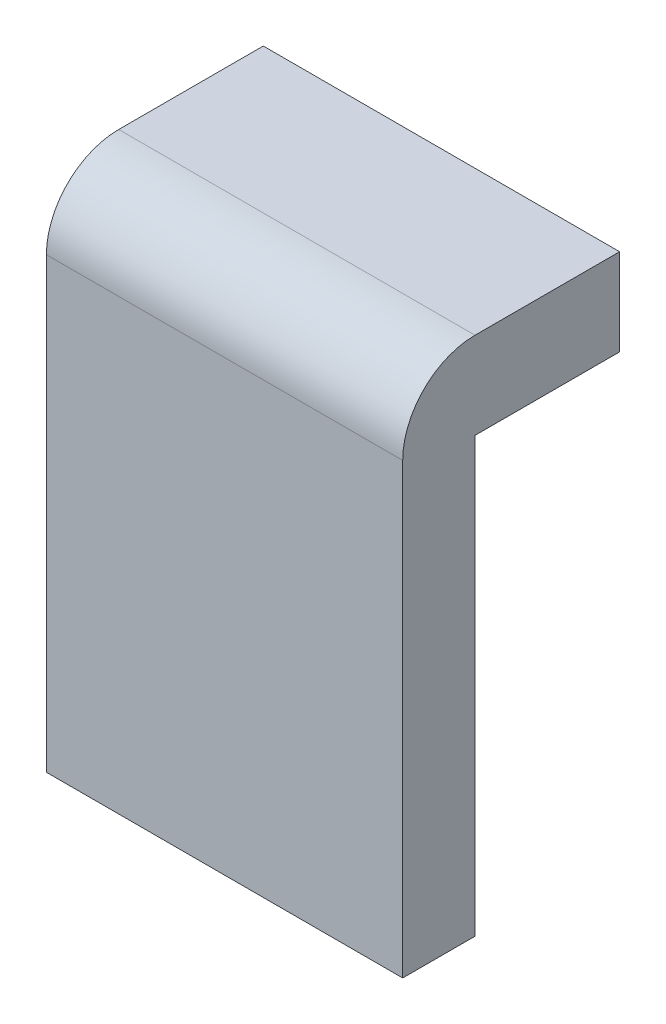
ISO-10303-21;
HEADER;
FILE_DESCRIPTION(('STEP AP214'),'2;1');
FILE_NAME('part.step','',(''),(''),'','','');
FILE_SCHEMA(('AUTOMOTIVE_DESIGN { 1 0 10303 214 1 1 1 1 }'));
ENDSEC;
DATA;
#1=APPLICATION_CONTEXT('core data for automotive mechanical design processes');
#2=APPLICATION_PROTOCOL_DEFINITION('international standard','automotive_design',2000,#1);
#3=PRODUCT_CONTEXT('',#1,'mechanical');
#4=PRODUCT('Part','Part','',(#3));
#5=PRODUCT_RELATED_PRODUCT_CATEGORY('part','',(#4));
#6=PRODUCT_DEFINITION_FORMATION('','',#4);
#7=PRODUCT_DEFINITION_CONTEXT('part definition',#1,'design');
#8=PRODUCT_DEFINITION('design','',#6,#7);
#9=PRODUCT_DEFINITION_SHAPE('','',#8);
#10=(LENGTH_UNIT() NAMED_UNIT(*) SI_UNIT(.MILLI.,.METRE.));
#11=(NAMED_UNIT(*) PLANE_ANGLE_UNIT() SI_UNIT($,.RADIAN.));
#12=(NAMED_UNIT(*) SI_UNIT($,.STERADIAN.) SOLID_ANGLE_UNIT());
#13=UNCERTAINTY_MEASURE_WITH_UNIT(LENGTH_MEASURE(1.E-05),#10,'distance_accuracy_value','');
#14=(GEOMETRIC_REPRESENTATION_CONTEXT(3) GLOBAL_UNCERTAINTY_ASSIGNED_CONTEXT((#13)) GLOBAL_UNIT_ASSIGNED_CONTEXT((#10,
#11,#12)) REPRESENTATION_CONTEXT('',''));
#15=CARTESIAN_POINT('',(0.,0.,0.));
#16=DIRECTION('',(0.,0.,1.));
#17=DIRECTION('',(1.,0.,0.));
#18=AXIS2_PLACEMENT_3D('',#15,#16,#17);
#19=CARTESIAN_POINT('',(-8.34906661620967,8.30000000000001,12.2546737770755));
#20=DIRECTION('',(0.,0.,1.));
#21=DIRECTION('',(0.,-1.,0.));
#22=AXIS2_PLACEMENT_3D('',#19,#20,#21);
#23=PLANE('',#22);
#24=DIRECTION('',(1.,0.,0.));
#25=VECTOR('',#24,1.);
#26=CARTESIAN_POINT('',(-15.8147962412963,6.80000000000003,12.2546737770755));
#27=LINE('',#26,#25);
#28=CARTESIAN_POINT('',(19.2000008184274,6.80000000000003,12.2546737770755));
#29=VERTEX_POINT('',#28);
#30=CARTESIAN_POINT('',(20.4321515748681,6.80000000000003,12.2546737770755));
#31=VERTEX_POINT('',#30);
#32=EDGE_CURVE('E113',#29,#31,#27,.T.);
#33=ORIENTED_EDGE('',*,*,#32,.F.);
#34=DIRECTION('',(0.,1.,0.));
#35=VECTOR('',#34,1.);
#36=CARTESIAN_POINT('',(19.2000008184274,5.35753839337147,12.2546737770755));
#37=LINE('',#36,#35);
#38=CARTESIAN_POINT('',(19.2000008184274,8.30000000000001,12.2546737770755));
#39=VERTEX_POINT('',#38);
#40=EDGE_CURVE('E148',#39,#29,#37,.F.);
#41=ORIENTED_EDGE('',*,*,#40,.F.);
#42=DIRECTION('',(1.,0.,0.));
#43=VECTOR('',#42,1.);
#44=CARTESIAN_POINT('',(-8.34906661620967,8.30000000000001,12.2546737770755));
#45=LINE('',#44,#43);
#46=CARTESIAN_POINT('',(20.4321515748681,8.30000000000001,12.2546737770755));
#47=VERTEX_POINT('',#46);
#48=EDGE_CURVE('E133',#39,#47,#45,.T.);
#49=ORIENTED_EDGE('',*,*,#48,.T.);
#50=DIRECTION('',(0.,1.,0.));
#51=VECTOR('',#50,1.);
#52=CARTESIAN_POINT('',(20.4321515748681,5.35753839337147,12.2546737770755));
#53=LINE('',#52,#51);
#54=EDGE_CURVE('E105',#31,#47,#53,.T.);
#55=ORIENTED_EDGE('',*,*,#54,.F.);
#56=EDGE_LOOP('',(#33,#41,#49,#55));
#57=FACE_BOUND('',#56,.T.);
#58=ADVANCED_FACE('F17',(#57),#23,.F.);
#59=CARTESIAN_POINT('',(-8.34906661620967,8.30000000000001,11.7546737770755));
#60=DIRECTION('',(0.,1.,0.));
#61=DIRECTION('',(0.,0.,1.));
#62=AXIS2_PLACEMENT_3D('',#59,#60,#61);
#63=PLANE('',#62);
#64=ORIENTED_EDGE('',*,*,#48,.F.);
#65=DIRECTION('',(0.,0.,1.));
#66=VECTOR('',#65,1.);
#67=CARTESIAN_POINT('',(19.2000008184274,8.30000000000001,12.5046737770755));
#68=LINE('',#67,#66);
#69=CARTESIAN_POINT('',(19.2000008184274,8.30000000000001,11.7546737770755));
#70=VERTEX_POINT('',#69);
#71=EDGE_CURVE('E153',#70,#39,#68,.T.);
#72=ORIENTED_EDGE('',*,*,#71,.F.);
#73=DIRECTION('',(1.,0.,0.));
#74=VECTOR('',#73,1.);
#75=CARTESIAN_POINT('',(19.2000008184274,8.30000000000001,11.7546737770755));
#76=LINE('',#75,#74);
#77=CARTESIAN_POINT('',(20.4321515748681,8.30000000000001,11.7546737770755));
#78=VERTEX_POINT('',#77);
#79=EDGE_CURVE('E124',#78,#70,#76,.F.);
#80=ORIENTED_EDGE('',*,*,#79,.F.);
#81=DIRECTION('',(0.,0.,-1.));
#82=VECTOR('',#81,1.);
#83=CARTESIAN_POINT('',(20.4321515748681,8.30000000000001,12.5046737770755));
#84=LINE('',#83,#82);
#85=EDGE_CURVE('E129',#47,#78,#84,.T.);
#86=ORIENTED_EDGE('',*,*,#85,.F.);
#87=EDGE_LOOP('',(#64,#72,#80,#86));
#88=FACE_BOUND('',#87,.T.);
#89=ADVANCED_FACE('F175',(#88),#63,.F.);
#90=CARTESIAN_POINT('',(19.2000008184274,5.35753839337146,11.7546737770755));
#91=DIRECTION('',(0.,0.,-1.));
#92=DIRECTION('',(0.,1.,0.));
#93=AXIS2_PLACEMENT_3D('',#90,#91,#92);
#94=PLANE('',#93);
#95=ORIENTED_EDGE('',*,*,#79,.T.);
#96=DIRECTION('',(0.,1.,0.));
#97=VECTOR('',#96,1.);
#98=CARTESIAN_POINT('',(19.2000008184274,5.35753839337147,11.7546737770755));
#99=LINE('',#98,#97);
#100=CARTESIAN_POINT('',(19.2000008184274,8.6,11.7546737770755));
#101=VERTEX_POINT('',#100);
#102=EDGE_CURVE('E119',#101,#70,#99,.F.);
#103=ORIENTED_EDGE('',*,*,#102,.F.);
#104=DIRECTION('',(1.,0.,0.));
#105=VECTOR('',#104,1.);
#106=CARTESIAN_POINT('',(-8.34906661620967,8.6,11.7546737770755));
#107=LINE('',#106,#105);
#108=CARTESIAN_POINT('',(20.4321515748681,8.6,11.7546737770755));
#109=VERTEX_POINT('',#108);
#110=EDGE_CURVE('E122',#101,#109,#107,.T.);
#111=ORIENTED_EDGE('',*,*,#110,.T.);
#112=DIRECTION('',(0.,1.,0.));
#113=VECTOR('',#112,1.);
#114=CARTESIAN_POINT('',(20.4321515748681,5.35753839337147,11.7546737770755));
#115=LINE('',#114,#113);
#116=EDGE_CURVE('E97',#78,#109,#115,.T.);
#117=ORIENTED_EDGE('',*,*,#116,.F.);
#118=EDGE_LOOP('',(#95,#103,#111,#117));
#119=FACE_BOUND('',#118,.T.);
#120=ADVANCED_FACE('F172',(#119),#94,.T.);
#121=CARTESIAN_POINT('',(-8.34906661620967,8.6,11.7546737770755));
#122=DIRECTION('',(0.,-1.,0.));
#123=DIRECTION('',(0.,0.,-1.));
#124=AXIS2_PLACEMENT_3D('',#121,#122,#123);
#125=PLANE('',#124);
#126=ORIENTED_EDGE('',*,*,#110,.F.);
#127=DIRECTION('',(0.,0.,1.));
#128=VECTOR('',#127,1.);
#129=CARTESIAN_POINT('',(19.2000008184274,8.6,12.5046737770755));
#130=LINE('',#129,#128);
#131=CARTESIAN_POINT('',(19.2000008184274,8.6,12.2546737770755));
#132=VERTEX_POINT('',#131);
#133=EDGE_CURVE('E83',#132,#101,#130,.F.);
#134=ORIENTED_EDGE('',*,*,#133,.F.);
#135=DIRECTION('',(1.,0.,0.));
#136=VECTOR('',#135,1.);
#137=CARTESIAN_POINT('',(-8.34906661620967,8.6,12.2546737770755));
#138=LINE('',#137,#136);
#139=CARTESIAN_POINT('',(20.4321515748681,8.6,12.2546737770755));
#140=VERTEX_POINT('',#139);
#141=EDGE_CURVE('E79',#140,#132,#138,.F.);
#142=ORIENTED_EDGE('',*,*,#141,.F.);
#143=DIRECTION('',(0.,0.,-1.));
#144=VECTOR('',#143,1.);
#145=CARTESIAN_POINT('',(20.4321515748681,8.6,12.5046737770755));
#146=LINE('',#145,#144);
#147=EDGE_CURVE('E94',#109,#140,#146,.F.);
#148=ORIENTED_EDGE('',*,*,#147,.F.);
#149=EDGE_LOOP('',(#126,#134,#142,#148));
#150=FACE_BOUND('',#149,.T.);
#151=ADVANCED_FACE('F168',(#150),#125,.F.);
#152=CARTESIAN_POINT('',(-8.34906661620967,8.35,12.2546737770755));
#153=DIRECTION('',(1.,0.,0.));
#154=DIRECTION('',(0.,0.,-1.));
#155=AXIS2_PLACEMENT_3D('',#152,#153,#154);
#156=CYLINDRICAL_SURFACE('',#155,0.249999999999995);
#157=CARTESIAN_POINT('',(19.2000008184274,8.35,12.2546737770755));
#158=DIRECTION('',(1.,0.,0.));
#159=DIRECTION('',(0.,0.,-1.));
#160=AXIS2_PLACEMENT_3D('',#157,#158,#159);
#161=CIRCLE('',#160,0.249999999999995);
#162=CARTESIAN_POINT('',(19.2000008184274,8.35,12.5046737770755));
#163=VERTEX_POINT('',#162);
#164=EDGE_CURVE('E20',#163,#132,#161,.F.);
#165=ORIENTED_EDGE('',*,*,#164,.F.);
#166=DIRECTION('',(1.,0.,0.));
#167=VECTOR('',#166,1.);
#168=CARTESIAN_POINT('',(19.2000008184274,8.35,12.5046737770755));
#169=LINE('',#168,#167);
#170=CARTESIAN_POINT('',(20.4321515748681,8.35,12.5046737770755));
#171=VERTEX_POINT('',#170);
#172=EDGE_CURVE('E77',#171,#163,#169,.F.);
#173=ORIENTED_EDGE('',*,*,#172,.F.);
#174=CARTESIAN_POINT('',(20.4321515748681,8.35,12.2546737770755));
#175=DIRECTION('',(1.,0.,0.));
#176=DIRECTION('',(0.,0.,-1.));
#177=AXIS2_PLACEMENT_3D('',#174,#175,#176);
#178=CIRCLE('',#177,0.249999999999995);
#179=EDGE_CURVE('E106',#140,#171,#178,.T.);
#180=ORIENTED_EDGE('',*,*,#179,.F.);
#181=ORIENTED_EDGE('',*,*,#141,.T.);
#182=EDGE_LOOP('',(#165,#173,#180,#181));
#183=FACE_BOUND('',#182,.T.);
#184=ADVANCED_FACE('F74',(#183),#156,.T.);
#185=CARTESIAN_POINT('',(19.2000008184274,5.35753839337147,12.5046737770755));
#186=DIRECTION('',(-1.,0.,0.));
#187=DIRECTION('',(0.,0.,1.));
#188=AXIS2_PLACEMENT_3D('',#185,#186,#187);
#189=PLANE('',#188);
#190=DIRECTION('',(0.,0.,-1.));
#191=VECTOR('',#190,1.);
#192=CARTESIAN_POINT('',(19.2000008184274,6.80000000000003,12.5046737770755));
#193=LINE('',#192,#191);
#194=CARTESIAN_POINT('',(19.2000008184274,6.80000000000003,12.5046737770755));
#195=VERTEX_POINT('',#194);
#196=EDGE_CURVE('E89',#195,#29,#193,.T.);
#197=ORIENTED_EDGE('',*,*,#196,.F.);
#198=DIRECTION('',(0.,-1.,0.));
#199=VECTOR('',#198,1.);
#200=CARTESIAN_POINT('',(19.2000008184274,5.35753839337147,12.5046737770755));
#201=LINE('',#200,#199);
#202=EDGE_CURVE('E85',#163,#195,#201,.T.);
#203=ORIENTED_EDGE('',*,*,#202,.F.);
#204=ORIENTED_EDGE('',*,*,#164,.T.);
#205=ORIENTED_EDGE('',*,*,#133,.T.);
#206=ORIENTED_EDGE('',*,*,#102,.T.);
#207=ORIENTED_EDGE('',*,*,#71,.T.);
#208=ORIENTED_EDGE('',*,*,#40,.T.);
#209=EDGE_LOOP('',(#197,#203,#204,#205,#206,#207,#208));
#210=FACE_BOUND('',#209,.T.);
#211=ADVANCED_FACE('F86',(#210),#189,.T.);
#212=CARTESIAN_POINT('',(-15.8147962412963,6.80000000000003,12.5046737770755));
#213=DIRECTION('',(0.,-1.,0.));
#214=DIRECTION('',(0.,0.,-1.));
#215=AXIS2_PLACEMENT_3D('',#212,#213,#214);
#216=PLANE('',#215);
#217=DIRECTION('',(1.,0.,0.));
#218=VECTOR('',#217,1.);
#219=CARTESIAN_POINT('',(19.2000008184274,6.80000000000003,12.5046737770755));
#220=LINE('',#219,#218);
#221=CARTESIAN_POINT('',(20.4321515748681,6.80000000000003,12.5046737770755));
#222=VERTEX_POINT('',#221);
#223=EDGE_CURVE('E26',#195,#222,#220,.T.);
#224=ORIENTED_EDGE('',*,*,#223,.F.);
#225=ORIENTED_EDGE('',*,*,#196,.T.);
#226=ORIENTED_EDGE('',*,*,#32,.T.);
#227=DIRECTION('',(0.,0.,-1.));
#228=VECTOR('',#227,1.);
#229=CARTESIAN_POINT('',(20.4321515748681,6.80000000000003,12.5046737770755));
#230=LINE('',#229,#228);
#231=EDGE_CURVE('E35',#222,#31,#230,.T.);
#232=ORIENTED_EDGE('',*,*,#231,.F.);
#233=EDGE_LOOP('',(#224,#225,#226,#232));
#234=FACE_BOUND('',#233,.T.);
#235=ADVANCED_FACE('F179',(#234),#216,.T.);
#236=CARTESIAN_POINT('',(20.4321515748681,5.35753839337147,12.5046737770755));
#237=DIRECTION('',(1.,0.,0.));
#238=DIRECTION('',(0.,0.,-1.));
#239=AXIS2_PLACEMENT_3D('',#236,#237,#238);
#240=PLANE('',#239);
#241=ORIENTED_EDGE('',*,*,#116,.T.);
#242=ORIENTED_EDGE('',*,*,#147,.T.);
#243=ORIENTED_EDGE('',*,*,#179,.T.);
#244=DIRECTION('',(0.,-1.,0.));
#245=VECTOR('',#244,1.);
#246=CARTESIAN_POINT('',(20.4321515748681,5.35753839337147,12.5046737770755));
#247=LINE('',#246,#245);
#248=EDGE_CURVE('E11',#222,#171,#247,.F.);
#249=ORIENTED_EDGE('',*,*,#248,.F.);
#250=ORIENTED_EDGE('',*,*,#231,.T.);
#251=ORIENTED_EDGE('',*,*,#54,.T.);
#252=ORIENTED_EDGE('',*,*,#85,.T.);
#253=EDGE_LOOP('',(#241,#242,#243,#249,#250,#251,#252));
#254=FACE_BOUND('',#253,.T.);
#255=ADVANCED_FACE('F164',(#254),#240,.T.);
#256=CARTESIAN_POINT('',(19.2000008184274,5.35753839337147,12.5046737770755));
#257=DIRECTION('',(0.,0.,1.));
#258=DIRECTION('',(0.,-1.,0.));
#259=AXIS2_PLACEMENT_3D('',#256,#257,#258);
#260=PLANE('',#259);
#261=ORIENTED_EDGE('',*,*,#223,.T.);
#262=ORIENTED_EDGE('',*,*,#248,.T.);
#263=ORIENTED_EDGE('',*,*,#172,.T.);
#264=ORIENTED_EDGE('',*,*,#202,.T.);
#265=EDGE_LOOP('',(#261,#262,#263,#264));
#266=FACE_BOUND('',#265,.T.);
#267=ADVANCED_FACE('F93',(#266),#260,.T.);
#268=CLOSED_SHELL('',(#58,#89,#120,#151,#184,#211,#235,#255,#267));
#269=MANIFOLD_SOLID_BREP('B1',#268);
#270=ADVANCED_BREP_SHAPE_REPRESENTATION('',(#18,#269),#14);
#271=SHAPE_DEFINITION_REPRESENTATION(#9,#270);
ENDSEC;
END-ISO-10303-21;
